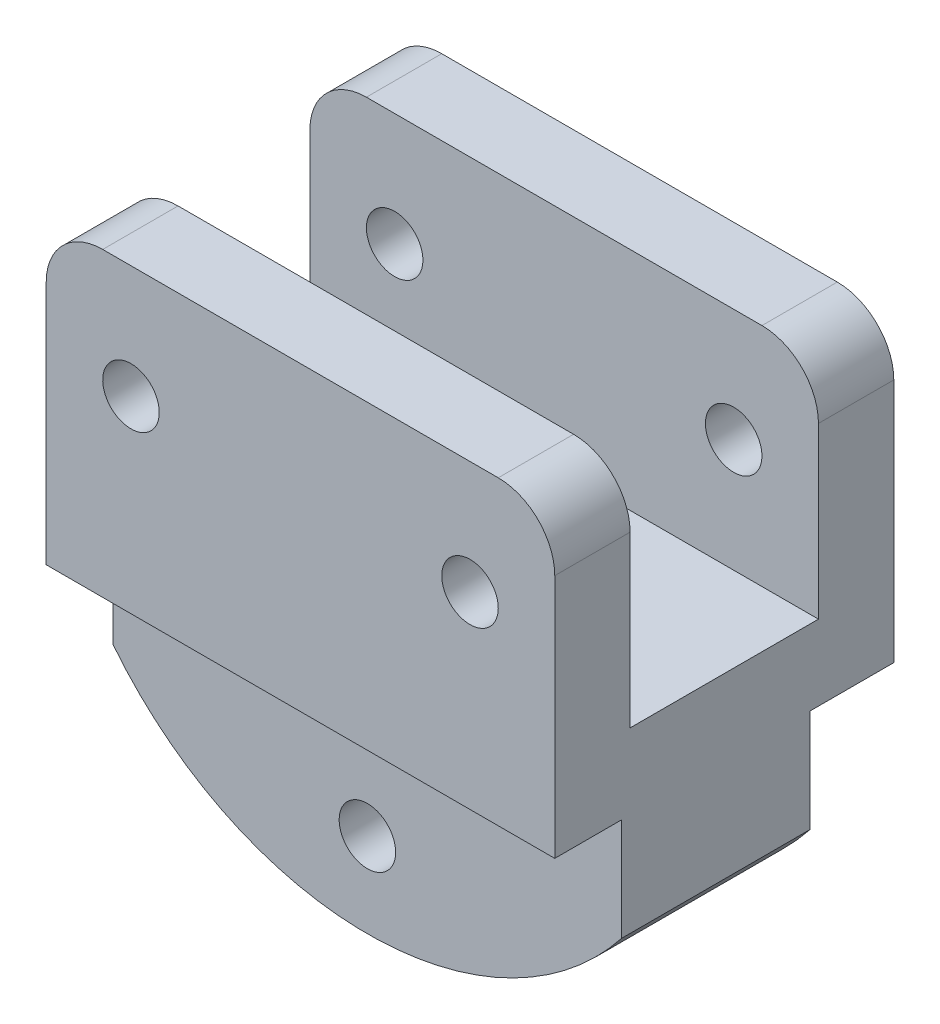
ISO-10303-21;
HEADER;
FILE_DESCRIPTION(('STEP AP214'),'2;1');
FILE_NAME('part.step','',(''),(''),'','','');
FILE_SCHEMA(('AUTOMOTIVE_DESIGN { 1 0 10303 214 1 1 1 1 }'));
ENDSEC;
DATA;
#1=APPLICATION_CONTEXT('core data for automotive mechanical design processes');
#2=APPLICATION_PROTOCOL_DEFINITION('international standard','automotive_design',2000,#1);
#3=PRODUCT_CONTEXT('',#1,'mechanical');
#4=PRODUCT('Part','Part','',(#3));
#5=PRODUCT_RELATED_PRODUCT_CATEGORY('part','',(#4));
#6=PRODUCT_DEFINITION_FORMATION('','',#4);
#7=PRODUCT_DEFINITION_CONTEXT('part definition',#1,'design');
#8=PRODUCT_DEFINITION('design','',#6,#7);
#9=PRODUCT_DEFINITION_SHAPE('','',#8);
#10=(LENGTH_UNIT() NAMED_UNIT(*) SI_UNIT(.MILLI.,.METRE.));
#11=(NAMED_UNIT(*) PLANE_ANGLE_UNIT() SI_UNIT($,.RADIAN.));
#12=(NAMED_UNIT(*) SI_UNIT($,.STERADIAN.) SOLID_ANGLE_UNIT());
#13=UNCERTAINTY_MEASURE_WITH_UNIT(LENGTH_MEASURE(1.E-05),#10,'distance_accuracy_value','');
#14=(GEOMETRIC_REPRESENTATION_CONTEXT(3) GLOBAL_UNCERTAINTY_ASSIGNED_CONTEXT((#13)) GLOBAL_UNIT_ASSIGNED_CONTEXT((#10,
#11,#12)) REPRESENTATION_CONTEXT('',''));
#15=CARTESIAN_POINT('',(0.,0.,0.));
#16=DIRECTION('',(0.,0.,1.));
#17=DIRECTION('',(1.,0.,0.));
#18=AXIS2_PLACEMENT_3D('',#15,#16,#17);
#19=CARTESIAN_POINT('',(24.,-3.,18.));
#20=DIRECTION('',(0.,0.,-1.));
#21=DIRECTION('',(-1.,0.,0.));
#22=AXIS2_PLACEMENT_3D('',#19,#20,#21);
#23=CYLINDRICAL_SURFACE('',#22,3.);
#24=DIRECTION('',(0.,0.,-1.));
#25=VECTOR('',#24,1.);
#26=CARTESIAN_POINT('',(24.,0.,18.));
#27=LINE('',#26,#25);
#28=CARTESIAN_POINT('',(24.,0.,18.));
#29=VERTEX_POINT('',#28);
#30=CARTESIAN_POINT('',(24.,0.,14.));
#31=VERTEX_POINT('',#30);
#32=EDGE_CURVE('E389',#29,#31,#27,.T.);
#33=ORIENTED_EDGE('',*,*,#32,.F.);
#34=CARTESIAN_POINT('',(24.,-3.,18.));
#35=DIRECTION('',(0.,0.,1.));
#36=DIRECTION('',(1.,0.,0.));
#37=AXIS2_PLACEMENT_3D('',#34,#35,#36);
#38=CIRCLE('',#37,3.);
#39=CARTESIAN_POINT('',(27.,-3.,18.));
#40=VERTEX_POINT('',#39);
#41=EDGE_CURVE('E97',#40,#29,#38,.T.);
#42=ORIENTED_EDGE('',*,*,#41,.F.);
#43=DIRECTION('',(0.,0.,-1.));
#44=VECTOR('',#43,1.);
#45=CARTESIAN_POINT('',(27.,-3.,18.));
#46=LINE('',#45,#44);
#47=CARTESIAN_POINT('',(27.,-3.,14.));
#48=VERTEX_POINT('',#47);
#49=EDGE_CURVE('E393',#48,#40,#46,.F.);
#50=ORIENTED_EDGE('',*,*,#49,.F.);
#51=CARTESIAN_POINT('',(24.,-3.,14.));
#52=DIRECTION('',(0.,0.,-1.));
#53=DIRECTION('',(0.,1.,0.));
#54=AXIS2_PLACEMENT_3D('',#51,#52,#53);
#55=CIRCLE('',#54,3.);
#56=EDGE_CURVE('E12',#31,#48,#55,.T.);
#57=ORIENTED_EDGE('',*,*,#56,.F.);
#58=EDGE_LOOP('',(#33,#42,#50,#57));
#59=FACE_BOUND('',#58,.T.);
#60=ADVANCED_FACE('F89',(#59),#23,.T.);
#61=CARTESIAN_POINT('',(3.,-3.,18.));
#62=DIRECTION('',(0.,0.,1.));
#63=DIRECTION('',(1.,0.,0.));
#64=AXIS2_PLACEMENT_3D('',#61,#62,#63);
#65=CYLINDRICAL_SURFACE('',#64,3.);
#66=DIRECTION('',(0.,0.,-1.));
#67=VECTOR('',#66,1.);
#68=CARTESIAN_POINT('',(0.,-3.,18.));
#69=LINE('',#68,#67);
#70=CARTESIAN_POINT('',(0.,-3.,18.));
#71=VERTEX_POINT('',#70);
#72=CARTESIAN_POINT('',(0.,-3.,14.));
#73=VERTEX_POINT('',#72);
#74=EDGE_CURVE('E374',#71,#73,#69,.T.);
#75=ORIENTED_EDGE('',*,*,#74,.F.);
#76=CARTESIAN_POINT('',(3.,-3.,18.));
#77=DIRECTION('',(0.,0.,1.));
#78=DIRECTION('',(1.,0.,0.));
#79=AXIS2_PLACEMENT_3D('',#76,#77,#78);
#80=CIRCLE('',#79,3.);
#81=CARTESIAN_POINT('',(3.,0.,18.));
#82=VERTEX_POINT('',#81);
#83=EDGE_CURVE('E382',#82,#71,#80,.T.);
#84=ORIENTED_EDGE('',*,*,#83,.F.);
#85=DIRECTION('',(0.,0.,-1.));
#86=VECTOR('',#85,1.);
#87=CARTESIAN_POINT('',(3.,0.,18.));
#88=LINE('',#87,#86);
#89=CARTESIAN_POINT('',(3.,0.,14.));
#90=VERTEX_POINT('',#89);
#91=EDGE_CURVE('E378',#90,#82,#88,.F.);
#92=ORIENTED_EDGE('',*,*,#91,.F.);
#93=CARTESIAN_POINT('',(3.,-3.,14.));
#94=DIRECTION('',(0.,0.,-1.));
#95=DIRECTION('',(0.,1.,0.));
#96=AXIS2_PLACEMENT_3D('',#93,#94,#95);
#97=CIRCLE('',#96,3.);
#98=EDGE_CURVE('E385',#73,#90,#97,.T.);
#99=ORIENTED_EDGE('',*,*,#98,.F.);
#100=EDGE_LOOP('',(#75,#84,#92,#99));
#101=FACE_BOUND('',#100,.T.);
#102=ADVANCED_FACE('F406',(#101),#65,.T.);
#103=CARTESIAN_POINT('',(24.,-3.,18.));
#104=DIRECTION('',(0.,0.,-1.));
#105=DIRECTION('',(-1.,0.,0.));
#106=AXIS2_PLACEMENT_3D('',#103,#104,#105);
#107=CYLINDRICAL_SURFACE('',#106,3.);
#108=CARTESIAN_POINT('',(24.,-3.,4.));
#109=DIRECTION('',(0.,0.,-1.));
#110=DIRECTION('',(0.,1.,0.));
#111=AXIS2_PLACEMENT_3D('',#108,#109,#110);
#112=CIRCLE('',#111,3.);
#113=CARTESIAN_POINT('',(27.,-3.,4.));
#114=VERTEX_POINT('',#113);
#115=CARTESIAN_POINT('',(24.,0.,4.));
#116=VERTEX_POINT('',#115);
#117=EDGE_CURVE('E360',#114,#116,#112,.F.);
#118=ORIENTED_EDGE('',*,*,#117,.F.);
#119=DIRECTION('',(0.,0.,-1.));
#120=VECTOR('',#119,1.);
#121=CARTESIAN_POINT('',(27.,-3.,18.));
#122=LINE('',#121,#120);
#123=CARTESIAN_POINT('',(27.,-3.,0.));
#124=VERTEX_POINT('',#123);
#125=EDGE_CURVE('E368',#124,#114,#122,.F.);
#126=ORIENTED_EDGE('',*,*,#125,.F.);
#127=CARTESIAN_POINT('',(24.,-3.,0.));
#128=DIRECTION('',(0.,0.,1.));
#129=DIRECTION('',(1.,0.,0.));
#130=AXIS2_PLACEMENT_3D('',#127,#128,#129);
#131=CIRCLE('',#130,3.);
#132=CARTESIAN_POINT('',(24.,0.,0.));
#133=VERTEX_POINT('',#132);
#134=EDGE_CURVE('E371',#133,#124,#131,.F.);
#135=ORIENTED_EDGE('',*,*,#134,.F.);
#136=DIRECTION('',(0.,0.,-1.));
#137=VECTOR('',#136,1.);
#138=CARTESIAN_POINT('',(24.,0.,18.));
#139=LINE('',#138,#137);
#140=EDGE_CURVE('E364',#116,#133,#139,.T.);
#141=ORIENTED_EDGE('',*,*,#140,.F.);
#142=EDGE_LOOP('',(#118,#126,#135,#141));
#143=FACE_BOUND('',#142,.T.);
#144=ADVANCED_FACE('F454',(#143),#107,.T.);
#145=CARTESIAN_POINT('',(3.,-3.,18.));
#146=DIRECTION('',(0.,0.,1.));
#147=DIRECTION('',(1.,0.,0.));
#148=AXIS2_PLACEMENT_3D('',#145,#146,#147);
#149=CYLINDRICAL_SURFACE('',#148,3.);
#150=DIRECTION('',(0.,0.,-1.));
#151=VECTOR('',#150,1.);
#152=CARTESIAN_POINT('',(0.,-3.,18.));
#153=LINE('',#152,#151);
#154=CARTESIAN_POINT('',(0.,-3.,4.));
#155=VERTEX_POINT('',#154);
#156=CARTESIAN_POINT('',(0.,-3.,0.));
#157=VERTEX_POINT('',#156);
#158=EDGE_CURVE('E342',#155,#157,#153,.T.);
#159=ORIENTED_EDGE('',*,*,#158,.F.);
#160=CARTESIAN_POINT('',(3.,-3.,4.));
#161=DIRECTION('',(0.,0.,-1.));
#162=DIRECTION('',(0.,1.,0.));
#163=AXIS2_PLACEMENT_3D('',#160,#161,#162);
#164=CIRCLE('',#163,3.);
#165=CARTESIAN_POINT('',(3.,0.,4.));
#166=VERTEX_POINT('',#165);
#167=EDGE_CURVE('E354',#166,#155,#164,.F.);
#168=ORIENTED_EDGE('',*,*,#167,.F.);
#169=DIRECTION('',(0.,0.,-1.));
#170=VECTOR('',#169,1.);
#171=CARTESIAN_POINT('',(3.,0.,18.));
#172=LINE('',#171,#170);
#173=CARTESIAN_POINT('',(3.,0.,0.));
#174=VERTEX_POINT('',#173);
#175=EDGE_CURVE('E350',#174,#166,#172,.F.);
#176=ORIENTED_EDGE('',*,*,#175,.F.);
#177=CARTESIAN_POINT('',(3.,-3.,0.));
#178=DIRECTION('',(0.,0.,1.));
#179=DIRECTION('',(1.,0.,0.));
#180=AXIS2_PLACEMENT_3D('',#177,#178,#179);
#181=CIRCLE('',#180,3.);
#182=EDGE_CURVE('E357',#157,#174,#181,.F.);
#183=ORIENTED_EDGE('',*,*,#182,.F.);
#184=EDGE_LOOP('',(#159,#168,#176,#183));
#185=FACE_BOUND('',#184,.T.);
#186=ADVANCED_FACE('F438',(#185),#149,.T.);
#187=CARTESIAN_POINT('',(27.,0.,18.));
#188=DIRECTION('',(1.,0.,0.));
#189=DIRECTION('',(0.,1.,0.));
#190=AXIS2_PLACEMENT_3D('',#187,#188,#189);
#191=PLANE('',#190);
#192=DIRECTION('',(0.,1.,0.));
#193=VECTOR('',#192,1.);
#194=CARTESIAN_POINT('',(27.,0.,14.));
#195=LINE('',#194,#193);
#196=CARTESIAN_POINT('',(27.,-12.,14.));
#197=VERTEX_POINT('',#196);
#198=EDGE_CURVE('E265',#197,#48,#195,.T.);
#199=ORIENTED_EDGE('',*,*,#198,.T.);
#200=ORIENTED_EDGE('',*,*,#49,.T.);
#201=DIRECTION('',(0.,-1.,0.));
#202=VECTOR('',#201,1.);
#203=CARTESIAN_POINT('',(27.,0.,18.));
#204=LINE('',#203,#202);
#205=CARTESIAN_POINT('',(27.,-16.,18.));
#206=VERTEX_POINT('',#205);
#207=EDGE_CURVE('E285',#40,#206,#204,.T.);
#208=ORIENTED_EDGE('',*,*,#207,.T.);
#209=DIRECTION('',(0.,0.,-1.));
#210=VECTOR('',#209,1.);
#211=CARTESIAN_POINT('',(27.,-16.,18.));
#212=LINE('',#211,#210);
#213=CARTESIAN_POINT('',(27.,-16.,14.4472901810905));
#214=VERTEX_POINT('',#213);
#215=EDGE_CURVE('E330',#206,#214,#212,.T.);
#216=ORIENTED_EDGE('',*,*,#215,.T.);
#217=DIRECTION('',(0.,1.,0.));
#218=VECTOR('',#217,1.);
#219=CARTESIAN_POINT('',(27.,-28.,14.4472901810905));
#220=LINE('',#219,#218);
#221=CARTESIAN_POINT('',(27.,-21.4510267792723,14.4472901810905));
#222=VERTEX_POINT('',#221);
#223=EDGE_CURVE('E219',#222,#214,#220,.T.);
#224=ORIENTED_EDGE('',*,*,#223,.F.);
#225=DIRECTION('',(0.,0.,-1.));
#226=VECTOR('',#225,1.);
#227=CARTESIAN_POINT('',(27.,-21.4510267792723,16.4472901810905));
#228=LINE('',#227,#226);
#229=CARTESIAN_POINT('',(27.,-21.4510267792723,4.44729018109049));
#230=VERTEX_POINT('',#229);
#231=EDGE_CURVE('E201',#222,#230,#228,.T.);
#232=ORIENTED_EDGE('',*,*,#231,.T.);
#233=DIRECTION('',(0.,1.,0.));
#234=VECTOR('',#233,1.);
#235=CARTESIAN_POINT('',(27.,-28.,4.44729018109049));
#236=LINE('',#235,#234);
#237=CARTESIAN_POINT('',(27.,-16.,4.44729018109049));
#238=VERTEX_POINT('',#237);
#239=EDGE_CURVE('E216',#230,#238,#236,.T.);
#240=ORIENTED_EDGE('',*,*,#239,.T.);
#241=CARTESIAN_POINT('',(27.,-16.,0.));
#242=VERTEX_POINT('',#241);
#243=EDGE_CURVE('E329',#238,#242,#212,.T.);
#244=ORIENTED_EDGE('',*,*,#243,.T.);
#245=DIRECTION('',(0.,-1.,0.));
#246=VECTOR('',#245,1.);
#247=CARTESIAN_POINT('',(27.,0.,0.));
#248=LINE('',#247,#246);
#249=EDGE_CURVE('E308',#124,#242,#248,.T.);
#250=ORIENTED_EDGE('',*,*,#249,.F.);
#251=ORIENTED_EDGE('',*,*,#125,.T.);
#252=DIRECTION('',(0.,1.,0.));
#253=VECTOR('',#252,1.);
#254=CARTESIAN_POINT('',(27.,0.,4.));
#255=LINE('',#254,#253);
#256=CARTESIAN_POINT('',(27.,-12.,4.));
#257=VERTEX_POINT('',#256);
#258=EDGE_CURVE('E273',#257,#114,#255,.T.);
#259=ORIENTED_EDGE('',*,*,#258,.F.);
#260=DIRECTION('',(0.,0.,-1.));
#261=VECTOR('',#260,1.);
#262=CARTESIAN_POINT('',(27.,-12.,18.));
#263=LINE('',#262,#261);
#264=EDGE_CURVE('E277',#197,#257,#263,.T.);
#265=ORIENTED_EDGE('',*,*,#264,.F.);
#266=EDGE_LOOP('',(#199,#200,#208,#216,#224,#232,#240,#244,#250,#251,#259,#265));
#267=FACE_BOUND('',#266,.T.);
#268=ADVANCED_FACE('F214',(#267),#191,.T.);
#269=CARTESIAN_POINT('',(0.,0.,18.));
#270=DIRECTION('',(1.,0.,0.));
#271=DIRECTION('',(0.,1.,0.));
#272=AXIS2_PLACEMENT_3D('',#269,#270,#271);
#273=PLANE('',#272);
#274=DIRECTION('',(0.,-1.,0.));
#275=VECTOR('',#274,1.);
#276=CARTESIAN_POINT('',(0.,0.,18.));
#277=LINE('',#276,#275);
#278=CARTESIAN_POINT('',(0.,-16.,18.));
#279=VERTEX_POINT('',#278);
#280=EDGE_CURVE('E293',#71,#279,#277,.T.);
#281=ORIENTED_EDGE('',*,*,#280,.F.);
#282=ORIENTED_EDGE('',*,*,#74,.T.);
#283=DIRECTION('',(0.,-1.,0.));
#284=VECTOR('',#283,1.);
#285=CARTESIAN_POINT('',(0.,0.,14.));
#286=LINE('',#285,#284);
#287=CARTESIAN_POINT('',(0.,-12.,14.));
#288=VERTEX_POINT('',#287);
#289=EDGE_CURVE('E240',#73,#288,#286,.T.);
#290=ORIENTED_EDGE('',*,*,#289,.T.);
#291=DIRECTION('',(0.,0.,1.));
#292=VECTOR('',#291,1.);
#293=CARTESIAN_POINT('',(0.,-12.,4.));
#294=LINE('',#293,#292);
#295=CARTESIAN_POINT('',(0.,-12.,4.));
#296=VERTEX_POINT('',#295);
#297=EDGE_CURVE('E231',#296,#288,#294,.T.);
#298=ORIENTED_EDGE('',*,*,#297,.F.);
#299=DIRECTION('',(0.,-1.,0.));
#300=VECTOR('',#299,1.);
#301=CARTESIAN_POINT('',(0.,0.,4.));
#302=LINE('',#301,#300);
#303=EDGE_CURVE('E243',#155,#296,#302,.T.);
#304=ORIENTED_EDGE('',*,*,#303,.F.);
#305=ORIENTED_EDGE('',*,*,#158,.T.);
#306=DIRECTION('',(0.,-1.,0.));
#307=VECTOR('',#306,1.);
#308=CARTESIAN_POINT('',(0.,0.,0.));
#309=LINE('',#308,#307);
#310=CARTESIAN_POINT('',(0.,-16.,0.));
#311=VERTEX_POINT('',#310);
#312=EDGE_CURVE('E315',#157,#311,#309,.T.);
#313=ORIENTED_EDGE('',*,*,#312,.T.);
#314=DIRECTION('',(0.,0.,-1.));
#315=VECTOR('',#314,1.);
#316=CARTESIAN_POINT('',(0.,-16.,18.));
#317=LINE('',#316,#315);
#318=CARTESIAN_POINT('',(0.,-16.,4.44729018109049));
#319=VERTEX_POINT('',#318);
#320=EDGE_CURVE('E304',#319,#311,#317,.T.);
#321=ORIENTED_EDGE('',*,*,#320,.F.);
#322=DIRECTION('',(0.,1.,0.));
#323=VECTOR('',#322,1.);
#324=CARTESIAN_POINT('',(0.,-28.,4.44729018109049));
#325=LINE('',#324,#323);
#326=CARTESIAN_POINT('',(0.,-21.4510267792723,4.44729018109049));
#327=VERTEX_POINT('',#326);
#328=EDGE_CURVE('E227',#327,#319,#325,.T.);
#329=ORIENTED_EDGE('',*,*,#328,.F.);
#330=DIRECTION('',(0.,0.,-1.));
#331=VECTOR('',#330,1.);
#332=CARTESIAN_POINT('',(0.,-21.4510267792723,16.4472901810905));
#333=LINE('',#332,#331);
#334=CARTESIAN_POINT('',(0.,-21.4510267792723,14.4472901810905));
#335=VERTEX_POINT('',#334);
#336=EDGE_CURVE('E204',#335,#327,#333,.T.);
#337=ORIENTED_EDGE('',*,*,#336,.F.);
#338=DIRECTION('',(0.,1.,0.));
#339=VECTOR('',#338,1.);
#340=CARTESIAN_POINT('',(0.,-28.,14.4472901810905));
#341=LINE('',#340,#339);
#342=CARTESIAN_POINT('',(0.,-16.,14.4472901810905));
#343=VERTEX_POINT('',#342);
#344=EDGE_CURVE('E233',#335,#343,#341,.T.);
#345=ORIENTED_EDGE('',*,*,#344,.T.);
#346=EDGE_CURVE('E325',#279,#343,#317,.T.);
#347=ORIENTED_EDGE('',*,*,#346,.F.);
#348=EDGE_LOOP('',(#281,#282,#290,#298,#304,#305,#313,#321,#329,#337,#345,#347));
#349=FACE_BOUND('',#348,.T.);
#350=ADVANCED_FACE('F412',(#349),#273,.F.);
#351=CARTESIAN_POINT('',(0.,-28.,4.44729018109049));
#352=DIRECTION('',(0.,0.,1.));
#353=DIRECTION('',(1.,0.,0.));
#354=AXIS2_PLACEMENT_3D('',#351,#352,#353);
#355=PLANE('',#354);
#356=CARTESIAN_POINT('',(13.5,-23.5,4.44729018109049));
#357=DIRECTION('',(0.,0.,-1.));
#358=DIRECTION('',(-1.,0.,0.));
#359=AXIS2_PLACEMENT_3D('',#356,#357,#358);
#360=CIRCLE('',#359,1.5);
#361=CARTESIAN_POINT('',(12.,-23.5,4.44729018109049));
#362=VERTEX_POINT('',#361);
#363=EDGE_CURVE('E209',#362,#362,#360,.T.);
#364=ORIENTED_EDGE('',*,*,#363,.F.);
#365=EDGE_LOOP('',(#364));
#366=FACE_BOUND('',#365,.T.);
#367=CARTESIAN_POINT('',(13.5,-10.8016862065107,4.44729018109049));
#368=DIRECTION('',(0.,0.,-1.));
#369=DIRECTION('',(-1.,0.,0.));
#370=AXIS2_PLACEMENT_3D('',#367,#368,#369);
#371=CIRCLE('',#370,17.1947217085554);
#372=EDGE_CURVE('E198',#230,#327,#371,.T.);
#373=ORIENTED_EDGE('',*,*,#372,.T.);
#374=ORIENTED_EDGE('',*,*,#328,.T.);
#375=DIRECTION('',(1.,0.,0.));
#376=VECTOR('',#375,1.);
#377=CARTESIAN_POINT('',(0.,-16.,4.44729018109049));
#378=LINE('',#377,#376);
#379=EDGE_CURVE('E225',#319,#238,#378,.T.);
#380=ORIENTED_EDGE('',*,*,#379,.T.);
#381=ORIENTED_EDGE('',*,*,#239,.F.);
#382=EDGE_LOOP('',(#373,#374,#380,#381));
#383=FACE_BOUND('',#382,.T.);
#384=ADVANCED_FACE('F223',(#366,#383),#355,.F.);
#385=CARTESIAN_POINT('',(0.,-28.,14.4472901810905));
#386=DIRECTION('',(0.,0.,1.));
#387=DIRECTION('',(1.,0.,0.));
#388=AXIS2_PLACEMENT_3D('',#385,#386,#387);
#389=PLANE('',#388);
#390=CARTESIAN_POINT('',(13.5,-23.5,14.4472901810905));
#391=DIRECTION('',(0.,0.,1.));
#392=DIRECTION('',(1.,0.,0.));
#393=AXIS2_PLACEMENT_3D('',#390,#391,#392);
#394=CIRCLE('',#393,1.5);
#395=CARTESIAN_POINT('',(15.,-23.5,14.4472901810905));
#396=VERTEX_POINT('',#395);
#397=EDGE_CURVE('E343',#396,#396,#394,.T.);
#398=ORIENTED_EDGE('',*,*,#397,.F.);
#399=EDGE_LOOP('',(#398));
#400=FACE_BOUND('',#399,.T.);
#401=ORIENTED_EDGE('',*,*,#344,.F.);
#402=CARTESIAN_POINT('',(13.5,-10.8016862065107,14.4472901810905));
#403=DIRECTION('',(0.,0.,1.));
#404=DIRECTION('',(1.,0.,0.));
#405=AXIS2_PLACEMENT_3D('',#402,#403,#404);
#406=CIRCLE('',#405,17.1947217085554);
#407=EDGE_CURVE('E333',#335,#222,#406,.T.);
#408=ORIENTED_EDGE('',*,*,#407,.T.);
#409=ORIENTED_EDGE('',*,*,#223,.T.);
#410=DIRECTION('',(1.,0.,0.));
#411=VECTOR('',#410,1.);
#412=CARTESIAN_POINT('',(0.,-16.,14.4472901810905));
#413=LINE('',#412,#411);
#414=EDGE_CURVE('E418',#343,#214,#413,.T.);
#415=ORIENTED_EDGE('',*,*,#414,.F.);
#416=EDGE_LOOP('',(#401,#408,#409,#415));
#417=FACE_BOUND('',#416,.T.);
#418=ADVANCED_FACE('F490',(#400,#417),#389,.T.);
#419=CARTESIAN_POINT('',(0.,-16.,18.));
#420=DIRECTION('',(0.,1.,0.));
#421=DIRECTION('',(-1.,0.,0.));
#422=AXIS2_PLACEMENT_3D('',#419,#420,#421);
#423=PLANE('',#422);
#424=ORIENTED_EDGE('',*,*,#379,.F.);
#425=ORIENTED_EDGE('',*,*,#320,.T.);
#426=DIRECTION('',(1.,0.,0.));
#427=VECTOR('',#426,1.);
#428=CARTESIAN_POINT('',(0.,-16.,0.));
#429=LINE('',#428,#427);
#430=EDGE_CURVE('E280',#311,#242,#429,.T.);
#431=ORIENTED_EDGE('',*,*,#430,.T.);
#432=ORIENTED_EDGE('',*,*,#243,.F.);
#433=EDGE_LOOP('',(#424,#425,#431,#432));
#434=FACE_BOUND('',#433,.T.);
#435=ADVANCED_FACE('F447',(#434),#423,.F.);
#436=CARTESIAN_POINT('',(0.,0.,18.));
#437=DIRECTION('',(0.,1.,0.));
#438=DIRECTION('',(-1.,0.,0.));
#439=AXIS2_PLACEMENT_3D('',#436,#437,#438);
#440=PLANE('',#439);
#441=DIRECTION('',(1.,0.,0.));
#442=VECTOR('',#441,1.);
#443=CARTESIAN_POINT('',(0.,0.,18.));
#444=LINE('',#443,#442);
#445=EDGE_CURVE('E289',#82,#29,#444,.T.);
#446=ORIENTED_EDGE('',*,*,#445,.T.);
#447=ORIENTED_EDGE('',*,*,#32,.T.);
#448=DIRECTION('',(-1.,0.,0.));
#449=VECTOR('',#448,1.);
#450=CARTESIAN_POINT('',(31.9999999999999,0.,14.));
#451=LINE('',#450,#449);
#452=EDGE_CURVE('E255',#31,#90,#451,.T.);
#453=ORIENTED_EDGE('',*,*,#452,.T.);
#454=ORIENTED_EDGE('',*,*,#91,.T.);
#455=EDGE_LOOP('',(#446,#447,#453,#454));
#456=FACE_BOUND('',#455,.T.);
#457=ADVANCED_FACE('F402',(#456),#440,.T.);
#458=CARTESIAN_POINT('',(22.5,-6.00000000000001,18.));
#459=DIRECTION('',(0.,0.,-1.));
#460=DIRECTION('',(-1.,0.,0.));
#461=AXIS2_PLACEMENT_3D('',#458,#459,#460);
#462=CYLINDRICAL_SURFACE('',#461,1.5);
#463=CARTESIAN_POINT('',(22.5,-6.00000000000001,18.));
#464=DIRECTION('',(0.,0.,1.));
#465=DIRECTION('',(1.,0.,0.));
#466=AXIS2_PLACEMENT_3D('',#463,#464,#465);
#467=CIRCLE('',#466,1.5);
#468=CARTESIAN_POINT('',(24.,-6.00000000000001,18.));
#469=VERTEX_POINT('',#468);
#470=EDGE_CURVE('E296',#469,#469,#467,.T.);
#471=ORIENTED_EDGE('',*,*,#470,.T.);
#472=EDGE_LOOP('',(#471));
#473=FACE_BOUND('',#472,.T.);
#474=CARTESIAN_POINT('',(22.5,-6.00000000000001,14.));
#475=DIRECTION('',(0.,0.,-1.));
#476=DIRECTION('',(0.,1.,0.));
#477=AXIS2_PLACEMENT_3D('',#474,#475,#476);
#478=CIRCLE('',#477,1.5);
#479=CARTESIAN_POINT('',(22.5,-4.50000000000001,14.));
#480=VERTEX_POINT('',#479);
#481=EDGE_CURVE('E261',#480,#480,#478,.T.);
#482=ORIENTED_EDGE('',*,*,#481,.T.);
#483=EDGE_LOOP('',(#482));
#484=FACE_BOUND('',#483,.T.);
#485=ADVANCED_FACE('F467',(#473,#484),#462,.F.);
#486=CARTESIAN_POINT('',(4.5,-6.,18.));
#487=DIRECTION('',(0.,0.,-1.));
#488=DIRECTION('',(-1.,0.,0.));
#489=AXIS2_PLACEMENT_3D('',#486,#487,#488);
#490=CYLINDRICAL_SURFACE('',#489,1.5);
#491=CARTESIAN_POINT('',(4.5,-6.,18.));
#492=DIRECTION('',(0.,0.,1.));
#493=DIRECTION('',(1.,0.,0.));
#494=AXIS2_PLACEMENT_3D('',#491,#492,#493);
#495=CIRCLE('',#494,1.5);
#496=CARTESIAN_POINT('',(6.,-6.,18.));
#497=VERTEX_POINT('',#496);
#498=EDGE_CURVE('E300',#497,#497,#495,.T.);
#499=ORIENTED_EDGE('',*,*,#498,.T.);
#500=EDGE_LOOP('',(#499));
#501=FACE_BOUND('',#500,.T.);
#502=CARTESIAN_POINT('',(4.5,-6.,14.));
#503=DIRECTION('',(0.,0.,-1.));
#504=DIRECTION('',(0.,1.,0.));
#505=AXIS2_PLACEMENT_3D('',#502,#503,#504);
#506=CIRCLE('',#505,1.5);
#507=CARTESIAN_POINT('',(4.5,-4.5,14.));
#508=VERTEX_POINT('',#507);
#509=EDGE_CURVE('E251',#508,#508,#506,.T.);
#510=ORIENTED_EDGE('',*,*,#509,.T.);
#511=EDGE_LOOP('',(#510));
#512=FACE_BOUND('',#511,.T.);
#513=ADVANCED_FACE('F468',(#501,#512),#490,.F.);
#514=ORIENTED_EDGE('',*,*,#346,.T.);
#515=ORIENTED_EDGE('',*,*,#414,.T.);
#516=ORIENTED_EDGE('',*,*,#215,.F.);
#517=DIRECTION('',(1.,0.,0.));
#518=VECTOR('',#517,1.);
#519=CARTESIAN_POINT('',(0.,-16.,18.));
#520=LINE('',#519,#518);
#521=EDGE_CURVE('E281',#279,#206,#520,.T.);
#522=ORIENTED_EDGE('',*,*,#521,.F.);
#523=EDGE_LOOP('',(#514,#515,#516,#522));
#524=FACE_BOUND('',#523,.T.);
#525=ADVANCED_FACE('F417',(#524),#423,.F.);
#526=DIRECTION('',(-1.,0.,0.));
#527=VECTOR('',#526,1.);
#528=CARTESIAN_POINT('',(31.9999999999999,0.,4.));
#529=LINE('',#528,#527);
#530=EDGE_CURVE('E252',#116,#166,#529,.T.);
#531=ORIENTED_EDGE('',*,*,#530,.F.);
#532=ORIENTED_EDGE('',*,*,#140,.T.);
#533=DIRECTION('',(1.,0.,0.));
#534=VECTOR('',#533,1.);
#535=CARTESIAN_POINT('',(0.,0.,0.));
#536=LINE('',#535,#534);
#537=EDGE_CURVE('E311',#174,#133,#536,.T.);
#538=ORIENTED_EDGE('',*,*,#537,.F.);
#539=ORIENTED_EDGE('',*,*,#175,.T.);
#540=EDGE_LOOP('',(#531,#532,#538,#539));
#541=FACE_BOUND('',#540,.T.);
#542=ADVANCED_FACE('F456',(#541),#440,.T.);
#543=CARTESIAN_POINT('',(22.5,-6.00000000000001,4.));
#544=DIRECTION('',(0.,0.,-1.));
#545=DIRECTION('',(0.,1.,0.));
#546=AXIS2_PLACEMENT_3D('',#543,#544,#545);
#547=CIRCLE('',#546,1.5);
#548=CARTESIAN_POINT('',(22.5,-4.50000000000001,4.));
#549=VERTEX_POINT('',#548);
#550=EDGE_CURVE('E269',#549,#549,#547,.T.);
#551=ORIENTED_EDGE('',*,*,#550,.F.);
#552=EDGE_LOOP('',(#551));
#553=FACE_BOUND('',#552,.T.);
#554=CARTESIAN_POINT('',(22.5,-6.00000000000001,0.));
#555=DIRECTION('',(0.,0.,1.));
#556=DIRECTION('',(1.,0.,0.));
#557=AXIS2_PLACEMENT_3D('',#554,#555,#556);
#558=CIRCLE('',#557,1.5);
#559=CARTESIAN_POINT('',(24.,-6.00000000000001,0.));
#560=VERTEX_POINT('',#559);
#561=EDGE_CURVE('E318',#560,#560,#558,.T.);
#562=ORIENTED_EDGE('',*,*,#561,.F.);
#563=EDGE_LOOP('',(#562));
#564=FACE_BOUND('',#563,.T.);
#565=ADVANCED_FACE('F458',(#553,#564),#462,.F.);
#566=CARTESIAN_POINT('',(4.5,-6.,4.));
#567=DIRECTION('',(0.,0.,-1.));
#568=DIRECTION('',(0.,1.,0.));
#569=AXIS2_PLACEMENT_3D('',#566,#567,#568);
#570=CIRCLE('',#569,1.5);
#571=CARTESIAN_POINT('',(4.5,-4.5,4.));
#572=VERTEX_POINT('',#571);
#573=EDGE_CURVE('E268',#572,#572,#570,.T.);
#574=ORIENTED_EDGE('',*,*,#573,.F.);
#575=EDGE_LOOP('',(#574));
#576=FACE_BOUND('',#575,.T.);
#577=CARTESIAN_POINT('',(4.5,-6.,0.));
#578=DIRECTION('',(0.,0.,1.));
#579=DIRECTION('',(1.,0.,0.));
#580=AXIS2_PLACEMENT_3D('',#577,#578,#579);
#581=CIRCLE('',#580,1.5);
#582=CARTESIAN_POINT('',(6.,-6.,0.));
#583=VERTEX_POINT('',#582);
#584=EDGE_CURVE('E286',#583,#583,#581,.T.);
#585=ORIENTED_EDGE('',*,*,#584,.F.);
#586=EDGE_LOOP('',(#585));
#587=FACE_BOUND('',#586,.T.);
#588=ADVANCED_FACE('F464',(#576,#587),#490,.F.);
#589=CARTESIAN_POINT('',(0.,0.,18.));
#590=DIRECTION('',(0.,0.,1.));
#591=DIRECTION('',(1.,0.,0.));
#592=AXIS2_PLACEMENT_3D('',#589,#590,#591);
#593=PLANE('',#592);
#594=ORIENTED_EDGE('',*,*,#207,.F.);
#595=ORIENTED_EDGE('',*,*,#41,.T.);
#596=ORIENTED_EDGE('',*,*,#445,.F.);
#597=ORIENTED_EDGE('',*,*,#83,.T.);
#598=ORIENTED_EDGE('',*,*,#280,.T.);
#599=ORIENTED_EDGE('',*,*,#521,.T.);
#600=EDGE_LOOP('',(#594,#595,#596,#597,#598,#599));
#601=FACE_BOUND('',#600,.T.);
#602=ORIENTED_EDGE('',*,*,#470,.F.);
#603=EDGE_LOOP('',(#602));
#604=FACE_BOUND('',#603,.T.);
#605=ORIENTED_EDGE('',*,*,#498,.F.);
#606=EDGE_LOOP('',(#605));
#607=FACE_BOUND('',#606,.T.);
#608=ADVANCED_FACE('F399',(#601,#604,#607),#593,.T.);
#609=CARTESIAN_POINT('',(0.,0.,0.));
#610=DIRECTION('',(0.,0.,1.));
#611=DIRECTION('',(1.,0.,0.));
#612=AXIS2_PLACEMENT_3D('',#609,#610,#611);
#613=PLANE('',#612);
#614=ORIENTED_EDGE('',*,*,#537,.T.);
#615=ORIENTED_EDGE('',*,*,#134,.T.);
#616=ORIENTED_EDGE('',*,*,#249,.T.);
#617=ORIENTED_EDGE('',*,*,#430,.F.);
#618=ORIENTED_EDGE('',*,*,#312,.F.);
#619=ORIENTED_EDGE('',*,*,#182,.T.);
#620=EDGE_LOOP('',(#614,#615,#616,#617,#618,#619));
#621=FACE_BOUND('',#620,.T.);
#622=ORIENTED_EDGE('',*,*,#561,.T.);
#623=EDGE_LOOP('',(#622));
#624=FACE_BOUND('',#623,.T.);
#625=ORIENTED_EDGE('',*,*,#584,.T.);
#626=EDGE_LOOP('',(#625));
#627=FACE_BOUND('',#626,.T.);
#628=ADVANCED_FACE('F441',(#621,#624,#627),#613,.F.);
#629=CARTESIAN_POINT('',(31.9999999999999,-12.,4.));
#630=DIRECTION('',(0.,-1.,0.));
#631=DIRECTION('',(0.,0.,-1.));
#632=AXIS2_PLACEMENT_3D('',#629,#630,#631);
#633=PLANE('',#632);
#634=ORIENTED_EDGE('',*,*,#264,.T.);
#635=DIRECTION('',(-1.,0.,0.));
#636=VECTOR('',#635,1.);
#637=CARTESIAN_POINT('',(31.9999999999999,-12.,4.));
#638=LINE('',#637,#636);
#639=EDGE_CURVE('E247',#257,#296,#638,.T.);
#640=ORIENTED_EDGE('',*,*,#639,.T.);
#641=ORIENTED_EDGE('',*,*,#297,.T.);
#642=DIRECTION('',(-1.,0.,0.));
#643=VECTOR('',#642,1.);
#644=CARTESIAN_POINT('',(31.9999999999999,-12.,14.));
#645=LINE('',#644,#643);
#646=EDGE_CURVE('E246',#197,#288,#645,.T.);
#647=ORIENTED_EDGE('',*,*,#646,.F.);
#648=EDGE_LOOP('',(#634,#640,#641,#647));
#649=FACE_BOUND('',#648,.T.);
#650=ADVANCED_FACE('F425',(#649),#633,.F.);
#651=CARTESIAN_POINT('',(31.9999999999999,0.,4.));
#652=DIRECTION('',(0.,0.,-1.));
#653=DIRECTION('',(0.,1.,0.));
#654=AXIS2_PLACEMENT_3D('',#651,#652,#653);
#655=PLANE('',#654);
#656=ORIENTED_EDGE('',*,*,#258,.T.);
#657=ORIENTED_EDGE('',*,*,#117,.T.);
#658=ORIENTED_EDGE('',*,*,#530,.T.);
#659=ORIENTED_EDGE('',*,*,#167,.T.);
#660=ORIENTED_EDGE('',*,*,#303,.T.);
#661=ORIENTED_EDGE('',*,*,#639,.F.);
#662=EDGE_LOOP('',(#656,#657,#658,#659,#660,#661));
#663=FACE_BOUND('',#662,.T.);
#664=ORIENTED_EDGE('',*,*,#550,.T.);
#665=EDGE_LOOP('',(#664));
#666=FACE_BOUND('',#665,.T.);
#667=ORIENTED_EDGE('',*,*,#573,.T.);
#668=EDGE_LOOP('',(#667));
#669=FACE_BOUND('',#668,.T.);
#670=ADVANCED_FACE('F432',(#663,#666,#669),#655,.F.);
#671=CARTESIAN_POINT('',(31.9999999999999,0.,14.));
#672=DIRECTION('',(0.,0.,-1.));
#673=DIRECTION('',(0.,1.,0.));
#674=AXIS2_PLACEMENT_3D('',#671,#672,#673);
#675=PLANE('',#674);
#676=ORIENTED_EDGE('',*,*,#481,.F.);
#677=EDGE_LOOP('',(#676));
#678=FACE_BOUND('',#677,.T.);
#679=ORIENTED_EDGE('',*,*,#509,.F.);
#680=EDGE_LOOP('',(#679));
#681=FACE_BOUND('',#680,.T.);
#682=ORIENTED_EDGE('',*,*,#452,.F.);
#683=ORIENTED_EDGE('',*,*,#56,.T.);
#684=ORIENTED_EDGE('',*,*,#198,.F.);
#685=ORIENTED_EDGE('',*,*,#646,.T.);
#686=ORIENTED_EDGE('',*,*,#289,.F.);
#687=ORIENTED_EDGE('',*,*,#98,.T.);
#688=EDGE_LOOP('',(#682,#683,#684,#685,#686,#687));
#689=FACE_BOUND('',#688,.T.);
#690=ADVANCED_FACE('F422',(#678,#681,#689),#675,.T.);
#691=CARTESIAN_POINT('',(13.5,-10.8016862065107,16.4472901810905));
#692=DIRECTION('',(0.,0.,-1.));
#693=DIRECTION('',(-1.,0.,0.));
#694=AXIS2_PLACEMENT_3D('',#691,#692,#693);
#695=CYLINDRICAL_SURFACE('',#694,17.1947217085554);
#696=ORIENTED_EDGE('',*,*,#336,.T.);
#697=ORIENTED_EDGE('',*,*,#372,.F.);
#698=ORIENTED_EDGE('',*,*,#231,.F.);
#699=ORIENTED_EDGE('',*,*,#407,.F.);
#700=EDGE_LOOP('',(#696,#697,#698,#699));
#701=FACE_BOUND('',#700,.T.);
#702=ADVANCED_FACE('F200',(#701),#695,.T.);
#703=CARTESIAN_POINT('',(13.5,-23.5,16.4472901810905));
#704=DIRECTION('',(0.,0.,-1.));
#705=DIRECTION('',(-1.,0.,0.));
#706=AXIS2_PLACEMENT_3D('',#703,#704,#705);
#707=CYLINDRICAL_SURFACE('',#706,1.5);
#708=ORIENTED_EDGE('',*,*,#397,.T.);
#709=EDGE_LOOP('',(#708));
#710=FACE_BOUND('',#709,.T.);
#711=ORIENTED_EDGE('',*,*,#363,.T.);
#712=EDGE_LOOP('',(#711));
#713=FACE_BOUND('',#712,.T.);
#714=ADVANCED_FACE('F513',(#710,#713),#707,.F.);
#715=CLOSED_SHELL('',(#60,#102,#144,#186,#268,#350,#384,#418,#435,#457,#485,#513,#525,#542,#565,
#588,#608,#628,#650,#670,#690,#702,#714));
#716=MANIFOLD_SOLID_BREP('B2',#715);
#717=ADVANCED_BREP_SHAPE_REPRESENTATION('',(#18,#716),#14);
#718=SHAPE_DEFINITION_REPRESENTATION(#9,#717);
ENDSEC;
END-ISO-10303-21;
